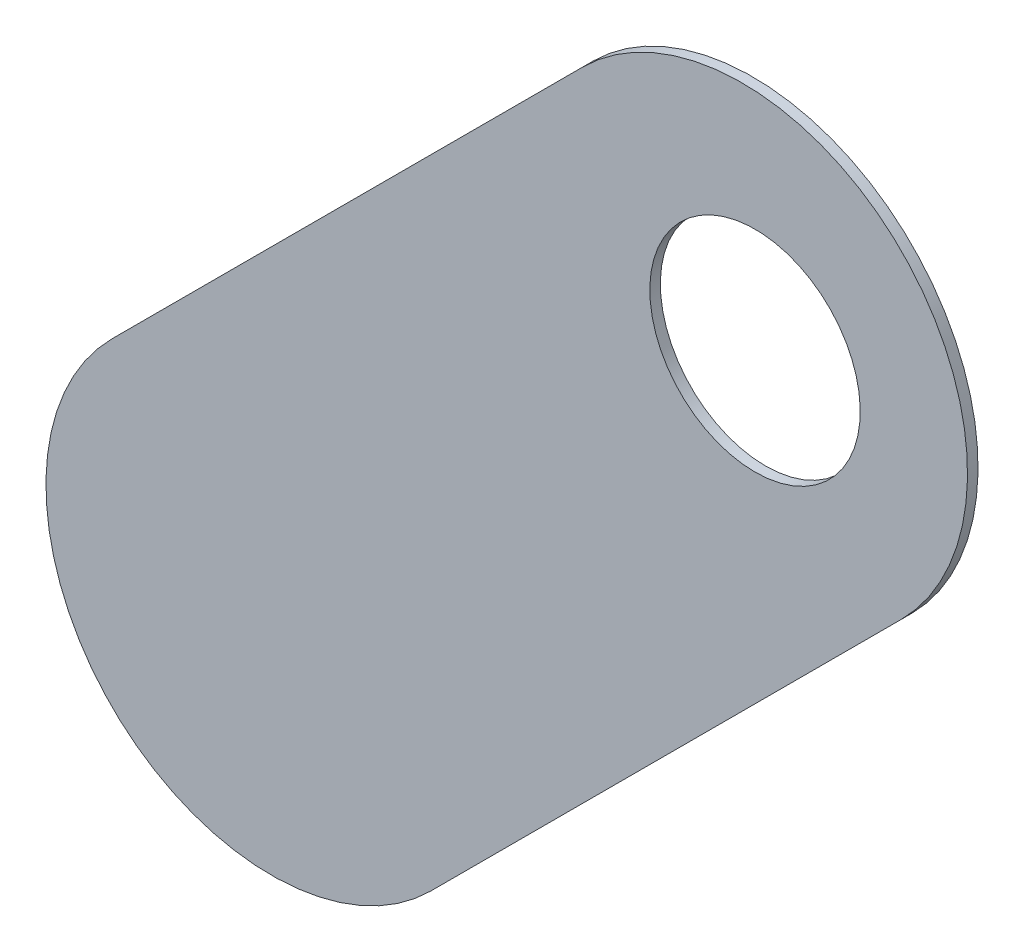
ISO-10303-21;
HEADER;
FILE_DESCRIPTION(('STEP AP214'),'2;1');
FILE_NAME('part.step','',(''),(''),'','','');
FILE_SCHEMA(('AUTOMOTIVE_DESIGN { 1 0 10303 214 1 1 1 1 }'));
ENDSEC;
DATA;
#1=APPLICATION_CONTEXT('core data for automotive mechanical design processes');
#2=APPLICATION_PROTOCOL_DEFINITION('international standard','automotive_design',2000,#1);
#3=PRODUCT_CONTEXT('',#1,'mechanical');
#4=PRODUCT('Part','Part','',(#3));
#5=PRODUCT_RELATED_PRODUCT_CATEGORY('part','',(#4));
#6=PRODUCT_DEFINITION_FORMATION('','',#4);
#7=PRODUCT_DEFINITION_CONTEXT('part definition',#1,'design');
#8=PRODUCT_DEFINITION('design','',#6,#7);
#9=PRODUCT_DEFINITION_SHAPE('','',#8);
#10=(LENGTH_UNIT() NAMED_UNIT(*) SI_UNIT(.MILLI.,.METRE.));
#11=(NAMED_UNIT(*) PLANE_ANGLE_UNIT() SI_UNIT($,.RADIAN.));
#12=(NAMED_UNIT(*) SI_UNIT($,.STERADIAN.) SOLID_ANGLE_UNIT());
#13=UNCERTAINTY_MEASURE_WITH_UNIT(LENGTH_MEASURE(1.E-05),#10,'distance_accuracy_value','');
#14=(GEOMETRIC_REPRESENTATION_CONTEXT(3) GLOBAL_UNCERTAINTY_ASSIGNED_CONTEXT((#13)) GLOBAL_UNIT_ASSIGNED_CONTEXT((#10,
#11,#12)) REPRESENTATION_CONTEXT('',''));
#15=CARTESIAN_POINT('',(0.,0.,0.));
#16=DIRECTION('',(0.,0.,1.));
#17=DIRECTION('',(1.,0.,0.));
#18=AXIS2_PLACEMENT_3D('',#15,#16,#17);
#19=CARTESIAN_POINT('',(115.401,-115.808,-0.045));
#20=DIRECTION('',(0.,0.,-1.));
#21=DIRECTION('',(0.,-1.,0.));
#22=AXIS2_PLACEMENT_3D('',#19,#20,#21);
#23=CYLINDRICAL_SURFACE('',#22,0.35);
#24=CARTESIAN_POINT('',(115.401,-115.808,-0.035));
#25=DIRECTION('',(0.,0.,-1.));
#26=DIRECTION('',(0.,-1.,0.));
#27=AXIS2_PLACEMENT_3D('',#24,#25,#26);
#28=CIRCLE('',#27,0.35);
#29=CARTESIAN_POINT('',(115.401,-116.158,-0.035));
#30=VERTEX_POINT('',#29);
#31=EDGE_CURVE('E116',#30,#30,#28,.T.);
#32=ORIENTED_EDGE('',*,*,#31,.T.);
#33=DIRECTION('',(0.,0.,1.));
#34=VECTOR('',#33,1.);
#35=CARTESIAN_POINT('',(115.401,-116.158,-0.045));
#36=LINE('',#35,#34);
#37=CARTESIAN_POINT('',(115.401,-116.158,0.));
#38=VERTEX_POINT('',#37);
#39=EDGE_CURVE('E11',#30,#38,#36,.T.);
#40=ORIENTED_EDGE('',*,*,#39,.T.);
#41=CARTESIAN_POINT('',(115.401,-115.808,0.));
#42=DIRECTION('',(0.,0.,-1.));
#43=DIRECTION('',(0.,-1.,0.));
#44=AXIS2_PLACEMENT_3D('',#41,#42,#43);
#45=CIRCLE('',#44,0.35);
#46=EDGE_CURVE('E25',#38,#38,#45,.T.);
#47=ORIENTED_EDGE('',*,*,#46,.F.);
#48=ORIENTED_EDGE('',*,*,#39,.F.);
#49=EDGE_LOOP('',(#32,#40,#47,#48));
#50=FACE_BOUND('',#49,.T.);
#51=ADVANCED_FACE('F17',(#50),#23,.F.);
#52=CARTESIAN_POINT('',(114.827669,-115.277669,-0.035));
#53=DIRECTION('',(0.707106781186548,-0.707106781186548,0.));
#54=DIRECTION('',(0.,0.,-1.));
#55=AXIS2_PLACEMENT_3D('',#52,#53,#54);
#56=PLANE('',#55);
#57=DIRECTION('',(-0.707106781186548,-0.707106781186548,0.));
#58=VECTOR('',#57,1.);
#59=CARTESIAN_POINT('',(114.827669,-115.277669,-0.035));
#60=LINE('',#59,#58);
#61=CARTESIAN_POINT('',(114.827669,-115.277669,-0.035));
#62=VERTEX_POINT('',#61);
#63=CARTESIAN_POINT('',(113.261669,-116.843669,-0.035));
#64=VERTEX_POINT('',#63);
#65=EDGE_CURVE('E119',#62,#64,#60,.T.);
#66=ORIENTED_EDGE('',*,*,#65,.T.);
#67=DIRECTION('',(0.,0.,1.));
#68=VECTOR('',#67,1.);
#69=CARTESIAN_POINT('',(113.261669,-116.843669,-0.035));
#70=LINE('',#69,#68);
#71=CARTESIAN_POINT('',(113.261669,-116.843669,0.));
#72=VERTEX_POINT('',#71);
#73=EDGE_CURVE('E83',#64,#72,#70,.T.);
#74=ORIENTED_EDGE('',*,*,#73,.T.);
#75=DIRECTION('',(-0.707106781186548,-0.707106781186548,0.));
#76=VECTOR('',#75,1.);
#77=CARTESIAN_POINT('',(114.827669,-115.277669,0.));
#78=LINE('',#77,#76);
#79=CARTESIAN_POINT('',(114.827669,-115.277669,0.));
#80=VERTEX_POINT('',#79);
#81=EDGE_CURVE('E114',#80,#72,#78,.T.);
#82=ORIENTED_EDGE('',*,*,#81,.F.);
#83=DIRECTION('',(0.,0.,1.));
#84=VECTOR('',#83,1.);
#85=CARTESIAN_POINT('',(114.827669,-115.277669,-0.035));
#86=LINE('',#85,#84);
#87=EDGE_CURVE('E122',#62,#80,#86,.T.);
#88=ORIENTED_EDGE('',*,*,#87,.F.);
#89=EDGE_LOOP('',(#66,#74,#82,#88));
#90=FACE_BOUND('',#89,.T.);
#91=ADVANCED_FACE('F140',(#90),#56,.F.);
#92=CARTESIAN_POINT('',(114.32233,-117.90433,0.));
#93=DIRECTION('',(0.,0.,1.));
#94=DIRECTION('',(1.,0.,0.));
#95=AXIS2_PLACEMENT_3D('',#92,#93,#94);
#96=PLANE('',#95);
#97=ORIENTED_EDGE('',*,*,#46,.T.);
#98=EDGE_LOOP('',(#97));
#99=FACE_BOUND('',#98,.T.);
#100=DIRECTION('',(0.707106781186548,0.707106781186548,0.));
#101=VECTOR('',#100,1.);
#102=CARTESIAN_POINT('',(114.32233,-117.90433,0.));
#103=LINE('',#102,#101);
#104=CARTESIAN_POINT('',(114.32233,-117.90433,0.));
#105=VERTEX_POINT('',#104);
#106=CARTESIAN_POINT('',(115.88833,-116.33833,0.));
#107=VERTEX_POINT('',#106);
#108=EDGE_CURVE('E95',#105,#107,#103,.T.);
#109=ORIENTED_EDGE('',*,*,#108,.T.);
#110=CARTESIAN_POINT('',(115.3579995,-115.8079995,0.));
#111=DIRECTION('',(0.,0.,1.));
#112=DIRECTION('',(0.707106781186548,-0.707106781186548,0.));
#113=AXIS2_PLACEMENT_3D('',#110,#111,#112);
#114=CIRCLE('',#113,0.75000058564);
#115=EDGE_CURVE('E125',#107,#80,#114,.T.);
#116=ORIENTED_EDGE('',*,*,#115,.T.);
#117=ORIENTED_EDGE('',*,*,#81,.T.);
#118=CARTESIAN_POINT('',(113.7919995,-117.3739995,0.));
#119=DIRECTION('',(0.,0.,1.));
#120=DIRECTION('',(-0.707106781186548,0.707106781186548,0.));
#121=AXIS2_PLACEMENT_3D('',#118,#119,#120);
#122=CIRCLE('',#121,0.75000058564);
#123=EDGE_CURVE('E87',#72,#105,#122,.T.);
#124=ORIENTED_EDGE('',*,*,#123,.T.);
#125=EDGE_LOOP('',(#109,#116,#117,#124));
#126=FACE_BOUND('',#125,.T.);
#127=ADVANCED_FACE('F137',(#99,#126),#96,.T.);
#128=CARTESIAN_POINT('',(114.32233,-117.90433,-0.035));
#129=DIRECTION('',(0.,0.,1.));
#130=DIRECTION('',(1.,0.,0.));
#131=AXIS2_PLACEMENT_3D('',#128,#129,#130);
#132=PLANE('',#131);
#133=ORIENTED_EDGE('',*,*,#31,.F.);
#134=EDGE_LOOP('',(#133));
#135=FACE_BOUND('',#134,.T.);
#136=CARTESIAN_POINT('',(113.7919995,-117.3739995,-0.035));
#137=DIRECTION('',(0.,0.,1.));
#138=DIRECTION('',(-0.707106781186548,0.707106781186548,0.));
#139=AXIS2_PLACEMENT_3D('',#136,#137,#138);
#140=CIRCLE('',#139,0.75000058564);
#141=CARTESIAN_POINT('',(114.32233,-117.90433,-0.035));
#142=VERTEX_POINT('',#141);
#143=EDGE_CURVE('E76',#64,#142,#140,.T.);
#144=ORIENTED_EDGE('',*,*,#143,.F.);
#145=ORIENTED_EDGE('',*,*,#65,.F.);
#146=CARTESIAN_POINT('',(115.3579995,-115.8079995,-0.035));
#147=DIRECTION('',(0.,0.,1.));
#148=DIRECTION('',(0.707106781186548,-0.707106781186548,0.));
#149=AXIS2_PLACEMENT_3D('',#146,#147,#148);
#150=CIRCLE('',#149,0.75000058564);
#151=CARTESIAN_POINT('',(115.88833,-116.33833,-0.035));
#152=VERTEX_POINT('',#151);
#153=EDGE_CURVE('E100',#152,#62,#150,.T.);
#154=ORIENTED_EDGE('',*,*,#153,.F.);
#155=DIRECTION('',(0.707106781186548,0.707106781186548,0.));
#156=VECTOR('',#155,1.);
#157=CARTESIAN_POINT('',(114.32233,-117.90433,-0.035));
#158=LINE('',#157,#156);
#159=EDGE_CURVE('E93',#142,#152,#158,.T.);
#160=ORIENTED_EDGE('',*,*,#159,.F.);
#161=EDGE_LOOP('',(#144,#145,#154,#160));
#162=FACE_BOUND('',#161,.T.);
#163=ADVANCED_FACE('F98',(#135,#162),#132,.F.);
#164=CARTESIAN_POINT('',(115.3579995,-115.8079995,-0.035));
#165=DIRECTION('',(0.,0.,-1.));
#166=DIRECTION('',(0.707106781186548,-0.707106781186548,0.));
#167=AXIS2_PLACEMENT_3D('',#164,#165,#166);
#168=CYLINDRICAL_SURFACE('',#167,0.75000058564);
#169=ORIENTED_EDGE('',*,*,#153,.T.);
#170=ORIENTED_EDGE('',*,*,#87,.T.);
#171=ORIENTED_EDGE('',*,*,#115,.F.);
#172=DIRECTION('',(0.,0.,1.));
#173=VECTOR('',#172,1.);
#174=CARTESIAN_POINT('',(115.88833,-116.33833,-0.035));
#175=LINE('',#174,#173);
#176=EDGE_CURVE('E103',#152,#107,#175,.T.);
#177=ORIENTED_EDGE('',*,*,#176,.F.);
#178=EDGE_LOOP('',(#169,#170,#171,#177));
#179=FACE_BOUND('',#178,.T.);
#180=ADVANCED_FACE('F148',(#179),#168,.T.);
#181=CARTESIAN_POINT('',(113.7919995,-117.3739995,-0.035));
#182=DIRECTION('',(0.,0.,-1.));
#183=DIRECTION('',(-0.707106781186548,0.707106781186548,0.));
#184=AXIS2_PLACEMENT_3D('',#181,#182,#183);
#185=CYLINDRICAL_SURFACE('',#184,0.75000058564);
#186=ORIENTED_EDGE('',*,*,#143,.T.);
#187=DIRECTION('',(0.,0.,1.));
#188=VECTOR('',#187,1.);
#189=CARTESIAN_POINT('',(114.32233,-117.90433,-0.035));
#190=LINE('',#189,#188);
#191=EDGE_CURVE('E80',#142,#105,#190,.T.);
#192=ORIENTED_EDGE('',*,*,#191,.T.);
#193=ORIENTED_EDGE('',*,*,#123,.F.);
#194=ORIENTED_EDGE('',*,*,#73,.F.);
#195=EDGE_LOOP('',(#186,#192,#193,#194));
#196=FACE_BOUND('',#195,.T.);
#197=ADVANCED_FACE('F78',(#196),#185,.T.);
#198=CARTESIAN_POINT('',(114.32233,-117.90433,-0.035));
#199=DIRECTION('',(-0.707106781186548,0.707106781186548,0.));
#200=DIRECTION('',(0.,0.,1.));
#201=AXIS2_PLACEMENT_3D('',#198,#199,#200);
#202=PLANE('',#201);
#203=ORIENTED_EDGE('',*,*,#159,.T.);
#204=ORIENTED_EDGE('',*,*,#176,.T.);
#205=ORIENTED_EDGE('',*,*,#108,.F.);
#206=ORIENTED_EDGE('',*,*,#191,.F.);
#207=EDGE_LOOP('',(#203,#204,#205,#206));
#208=FACE_BOUND('',#207,.T.);
#209=ADVANCED_FACE('F91',(#208),#202,.F.);
#210=CLOSED_SHELL('',(#51,#91,#127,#163,#180,#197,#209));
#211=MANIFOLD_SOLID_BREP('B1',#210);
#212=ADVANCED_BREP_SHAPE_REPRESENTATION('',(#18,#211),#14);
#213=SHAPE_DEFINITION_REPRESENTATION(#9,#212);
ENDSEC;
END-ISO-10303-21;
